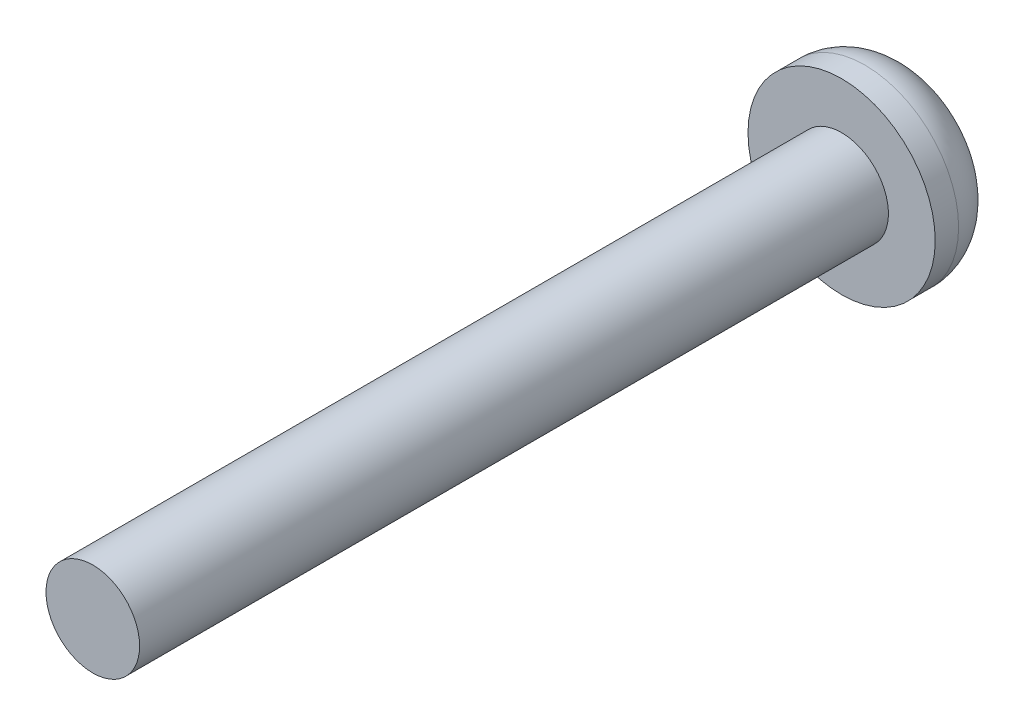
ISO-10303-21;
HEADER;
FILE_DESCRIPTION(('STEP AP214'),'2;1');
FILE_NAME('part.step','',(''),(''),'','','');
FILE_SCHEMA(('AUTOMOTIVE_DESIGN { 1 0 10303 214 1 1 1 1 }'));
ENDSEC;
DATA;
#1=APPLICATION_CONTEXT('core data for automotive mechanical design processes');
#2=APPLICATION_PROTOCOL_DEFINITION('international standard','automotive_design',2000,#1);
#3=PRODUCT_CONTEXT('',#1,'mechanical');
#4=PRODUCT('Part','Part','',(#3));
#5=PRODUCT_RELATED_PRODUCT_CATEGORY('part','',(#4));
#6=PRODUCT_DEFINITION_FORMATION('','',#4);
#7=PRODUCT_DEFINITION_CONTEXT('part definition',#1,'design');
#8=PRODUCT_DEFINITION('design','',#6,#7);
#9=PRODUCT_DEFINITION_SHAPE('','',#8);
#10=(LENGTH_UNIT() NAMED_UNIT(*) SI_UNIT(.MILLI.,.METRE.));
#11=(NAMED_UNIT(*) PLANE_ANGLE_UNIT() SI_UNIT($,.RADIAN.));
#12=(NAMED_UNIT(*) SI_UNIT($,.STERADIAN.) SOLID_ANGLE_UNIT());
#13=UNCERTAINTY_MEASURE_WITH_UNIT(LENGTH_MEASURE(1.E-05),#10,'distance_accuracy_value','');
#14=(GEOMETRIC_REPRESENTATION_CONTEXT(3) GLOBAL_UNCERTAINTY_ASSIGNED_CONTEXT((#13)) GLOBAL_UNIT_ASSIGNED_CONTEXT((#10,
#11,#12)) REPRESENTATION_CONTEXT('',''));
#15=CARTESIAN_POINT('',(0.,0.,0.));
#16=DIRECTION('',(0.,0.,1.));
#17=DIRECTION('',(1.,0.,0.));
#18=AXIS2_PLACEMENT_3D('',#15,#16,#17);
#19=CARTESIAN_POINT('',(0.,0.,16.));
#20=DIRECTION('',(0.,0.,-1.));
#21=DIRECTION('',(-1.,0.,0.));
#22=AXIS2_PLACEMENT_3D('',#19,#20,#21);
#23=CYLINDRICAL_SURFACE('',#22,1.);
#24=CARTESIAN_POINT('',(0.,0.,16.));
#25=DIRECTION('',(0.,0.,1.));
#26=DIRECTION('',(1.,0.,0.));
#27=AXIS2_PLACEMENT_3D('',#24,#25,#26);
#28=CIRCLE('',#27,1.);
#29=CARTESIAN_POINT('',(1.,0.,16.));
#30=VERTEX_POINT('',#29);
#31=EDGE_CURVE('E42',#30,#30,#28,.T.);
#32=ORIENTED_EDGE('',*,*,#31,.F.);
#33=EDGE_LOOP('',(#32));
#34=FACE_BOUND('',#33,.T.);
#35=CARTESIAN_POINT('',(0.,0.,0.));
#36=DIRECTION('',(0.,0.,-1.));
#37=DIRECTION('',(-1.,0.,0.));
#38=AXIS2_PLACEMENT_3D('',#35,#36,#37);
#39=CIRCLE('',#38,1.);
#40=CARTESIAN_POINT('',(-1.,0.,0.));
#41=VERTEX_POINT('',#40);
#42=EDGE_CURVE('E46',#41,#41,#39,.T.);
#43=ORIENTED_EDGE('',*,*,#42,.F.);
#44=EDGE_LOOP('',(#43));
#45=FACE_BOUND('',#44,.T.);
#46=ADVANCED_FACE('F31',(#34,#45),#23,.T.);
#47=CARTESIAN_POINT('',(0.,0.,16.));
#48=DIRECTION('',(0.,0.,1.));
#49=DIRECTION('',(1.,0.,0.));
#50=AXIS2_PLACEMENT_3D('',#47,#48,#49);
#51=PLANE('',#50);
#52=ORIENTED_EDGE('',*,*,#31,.T.);
#53=EDGE_LOOP('',(#52));
#54=FACE_BOUND('',#53,.T.);
#55=ADVANCED_FACE('F70',(#54),#51,.T.);
#56=CARTESIAN_POINT('',(0.,0.,-1.5));
#57=DIRECTION('',(0.,0.,1.));
#58=DIRECTION('',(1.,0.,0.));
#59=AXIS2_PLACEMENT_3D('',#56,#57,#58);
#60=CYLINDRICAL_SURFACE('',#59,2.);
#61=CARTESIAN_POINT('',(0.,0.,-0.5));
#62=DIRECTION('',(0.,0.,-1.));
#63=DIRECTION('',(-1.,0.,0.));
#64=AXIS2_PLACEMENT_3D('',#61,#62,#63);
#65=CIRCLE('',#64,2.);
#66=CARTESIAN_POINT('',(-2.,0.,-0.5));
#67=VERTEX_POINT('',#66);
#68=EDGE_CURVE('E10',#67,#67,#65,.F.);
#69=ORIENTED_EDGE('',*,*,#68,.T.);
#70=EDGE_LOOP('',(#69));
#71=FACE_BOUND('',#70,.T.);
#72=CARTESIAN_POINT('',(0.,0.,0.));
#73=DIRECTION('',(0.,0.,-1.));
#74=DIRECTION('',(-1.,0.,0.));
#75=AXIS2_PLACEMENT_3D('',#72,#73,#74);
#76=CIRCLE('',#75,2.);
#77=CARTESIAN_POINT('',(-2.,0.,0.));
#78=VERTEX_POINT('',#77);
#79=EDGE_CURVE('E51',#78,#78,#76,.T.);
#80=ORIENTED_EDGE('',*,*,#79,.T.);
#81=EDGE_LOOP('',(#80));
#82=FACE_BOUND('',#81,.T.);
#83=ADVANCED_FACE('F55',(#71,#82),#60,.T.);
#84=CARTESIAN_POINT('',(0.,0.,-1.5));
#85=DIRECTION('',(0.,0.,-1.));
#86=DIRECTION('',(-1.,0.,0.));
#87=AXIS2_PLACEMENT_3D('',#84,#85,#86);
#88=PLANE('',#87);
#89=CARTESIAN_POINT('',(0.,0.,-1.5));
#90=DIRECTION('',(0.,0.,-1.));
#91=DIRECTION('',(-1.,0.,0.));
#92=AXIS2_PLACEMENT_3D('',#89,#90,#91);
#93=CIRCLE('',#92,1.);
#94=CARTESIAN_POINT('',(-1.,0.,-1.5));
#95=VERTEX_POINT('',#94);
#96=EDGE_CURVE('E38',#95,#95,#93,.T.);
#97=ORIENTED_EDGE('',*,*,#96,.T.);
#98=EDGE_LOOP('',(#97));
#99=FACE_BOUND('',#98,.T.);
#100=ADVANCED_FACE('F59',(#99),#88,.T.);
#101=CARTESIAN_POINT('',(0.,0.,0.));
#102=DIRECTION('',(0.,0.,-1.));
#103=DIRECTION('',(-1.,0.,0.));
#104=AXIS2_PLACEMENT_3D('',#101,#102,#103);
#105=PLANE('',#104);
#106=ORIENTED_EDGE('',*,*,#42,.T.);
#107=EDGE_LOOP('',(#106));
#108=FACE_BOUND('',#107,.T.);
#109=ORIENTED_EDGE('',*,*,#79,.F.);
#110=EDGE_LOOP('',(#109));
#111=FACE_BOUND('',#110,.T.);
#112=ADVANCED_FACE('F57',(#108,#111),#105,.F.);
#113=CARTESIAN_POINT('',(0.,0.,-0.5));
#114=DIRECTION('',(0.,0.,-1.));
#115=DIRECTION('',(-1.,0.,0.));
#116=AXIS2_PLACEMENT_3D('',#113,#114,#115);
#117=DEGENERATE_TOROIDAL_SURFACE('',#116,1.,1.,.T.);
#118=ORIENTED_EDGE('',*,*,#68,.F.);
#119=EDGE_LOOP('',(#118));
#120=FACE_BOUND('',#119,.T.);
#121=ORIENTED_EDGE('',*,*,#96,.F.);
#122=EDGE_LOOP('',(#121));
#123=FACE_BOUND('',#122,.T.);
#124=ADVANCED_FACE('F33',(#120,#123),#117,.T.);
#125=CLOSED_SHELL('',(#46,#55,#83,#100,#112,#124));
#126=MANIFOLD_SOLID_BREP('B2',#125);
#127=ADVANCED_BREP_SHAPE_REPRESENTATION('',(#18,#126),#14);
#128=SHAPE_DEFINITION_REPRESENTATION(#9,#127);
ENDSEC;
END-ISO-10303-21;
